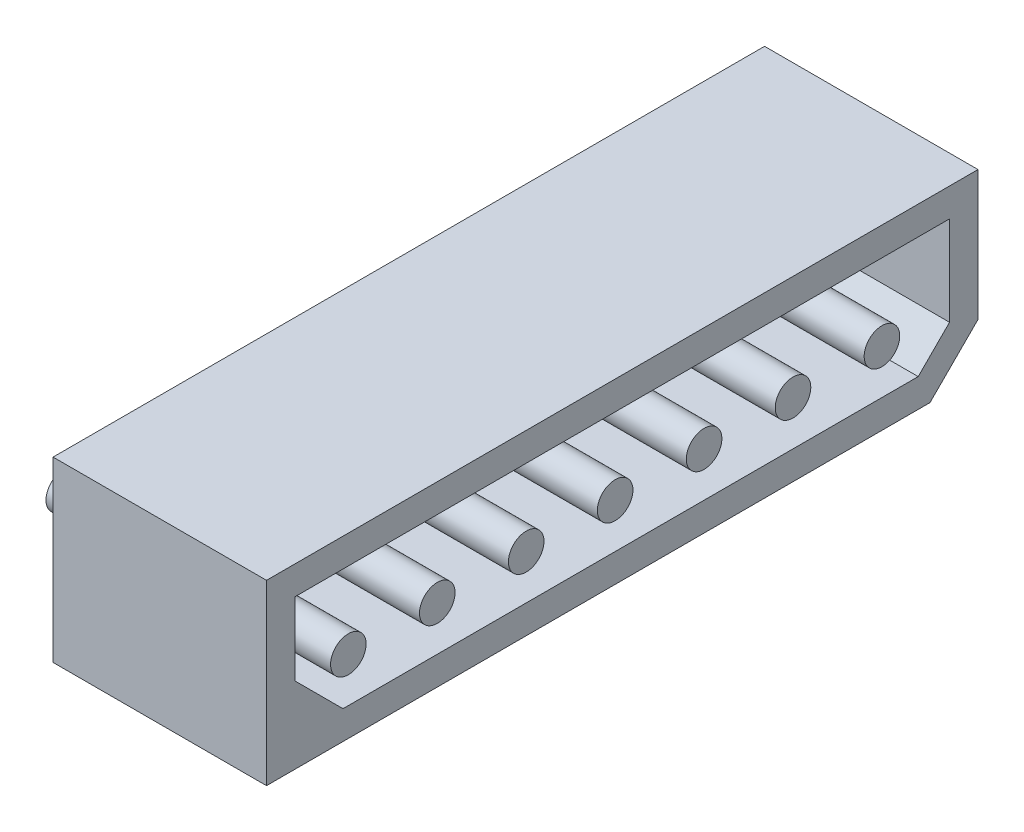
ISO-10303-21;
HEADER;
FILE_DESCRIPTION(('STEP AP214'),'2;1');
FILE_NAME('part.step','',(''),(''),'','','');
FILE_SCHEMA(('AUTOMOTIVE_DESIGN { 1 0 10303 214 1 1 1 1 }'));
ENDSEC;
DATA;
#1=APPLICATION_CONTEXT('core data for automotive mechanical design processes');
#2=APPLICATION_PROTOCOL_DEFINITION('international standard','automotive_design',2000,#1);
#3=PRODUCT_CONTEXT('',#1,'mechanical');
#4=PRODUCT('Part','Part','',(#3));
#5=PRODUCT_RELATED_PRODUCT_CATEGORY('part','',(#4));
#6=PRODUCT_DEFINITION_FORMATION('','',#4);
#7=PRODUCT_DEFINITION_CONTEXT('part definition',#1,'design');
#8=PRODUCT_DEFINITION('design','',#6,#7);
#9=PRODUCT_DEFINITION_SHAPE('','',#8);
#10=(LENGTH_UNIT() NAMED_UNIT(*) SI_UNIT(.MILLI.,.METRE.));
#11=(NAMED_UNIT(*) PLANE_ANGLE_UNIT() SI_UNIT($,.RADIAN.));
#12=(NAMED_UNIT(*) SI_UNIT($,.STERADIAN.) SOLID_ANGLE_UNIT());
#13=UNCERTAINTY_MEASURE_WITH_UNIT(LENGTH_MEASURE(1.E-05),#10,'distance_accuracy_value','');
#14=(GEOMETRIC_REPRESENTATION_CONTEXT(3) GLOBAL_UNCERTAINTY_ASSIGNED_CONTEXT((#13)) GLOBAL_UNIT_ASSIGNED_CONTEXT((#10,
#11,#12)) REPRESENTATION_CONTEXT('',''));
#15=CARTESIAN_POINT('',(0.,0.,0.));
#16=DIRECTION('',(0.,0.,1.));
#17=DIRECTION('',(1.,0.,0.));
#18=AXIS2_PLACEMENT_3D('',#15,#16,#17);
#19=CARTESIAN_POINT('',(5.8,-0.65,-7.5));
#20=DIRECTION('',(1.,0.,0.));
#21=DIRECTION('',(0.,0.,-1.));
#22=AXIS2_PLACEMENT_3D('',#19,#20,#21);
#23=PLANE('',#22);
#24=CARTESIAN_POINT('',(5.8,-0.65,-7.5));
#25=DIRECTION('',(1.,0.,0.));
#26=DIRECTION('',(0.,0.,-1.));
#27=AXIS2_PLACEMENT_3D('',#24,#25,#26);
#28=CIRCLE('',#27,0.5);
#29=CARTESIAN_POINT('',(5.8,-0.65,-8.));
#30=VERTEX_POINT('',#29);
#31=EDGE_CURVE('E20',#30,#30,#28,.F.);
#32=ORIENTED_EDGE('',*,*,#31,.F.);
#33=EDGE_LOOP('',(#32));
#34=FACE_BOUND('',#33,.T.);
#35=ADVANCED_FACE('F17',(#34),#23,.T.);
#36=CARTESIAN_POINT('',(5.8,-0.65,-5.));
#37=DIRECTION('',(1.,0.,0.));
#38=DIRECTION('',(0.,0.,-1.));
#39=AXIS2_PLACEMENT_3D('',#36,#37,#38);
#40=PLANE('',#39);
#41=CARTESIAN_POINT('',(5.8,-0.65,-5.));
#42=DIRECTION('',(1.,0.,0.));
#43=DIRECTION('',(0.,0.,-1.));
#44=AXIS2_PLACEMENT_3D('',#41,#42,#43);
#45=CIRCLE('',#44,0.5);
#46=CARTESIAN_POINT('',(5.8,-0.65,-5.5));
#47=VERTEX_POINT('',#46);
#48=EDGE_CURVE('E204',#47,#47,#45,.F.);
#49=ORIENTED_EDGE('',*,*,#48,.F.);
#50=EDGE_LOOP('',(#49));
#51=FACE_BOUND('',#50,.T.);
#52=ADVANCED_FACE('F215',(#51),#40,.T.);
#53=CARTESIAN_POINT('',(5.8,-0.65,-2.5));
#54=DIRECTION('',(1.,0.,0.));
#55=DIRECTION('',(0.,0.,-1.));
#56=AXIS2_PLACEMENT_3D('',#53,#54,#55);
#57=PLANE('',#56);
#58=CARTESIAN_POINT('',(5.8,-0.65,-2.5));
#59=DIRECTION('',(1.,0.,0.));
#60=DIRECTION('',(0.,0.,-1.));
#61=AXIS2_PLACEMENT_3D('',#58,#59,#60);
#62=CIRCLE('',#61,0.5);
#63=CARTESIAN_POINT('',(5.8,-0.65,-3.));
#64=VERTEX_POINT('',#63);
#65=EDGE_CURVE('E202',#64,#64,#62,.F.);
#66=ORIENTED_EDGE('',*,*,#65,.F.);
#67=EDGE_LOOP('',(#66));
#68=FACE_BOUND('',#67,.T.);
#69=ADVANCED_FACE('F220',(#68),#57,.T.);
#70=CARTESIAN_POINT('',(5.8,-0.65,0.));
#71=DIRECTION('',(1.,0.,0.));
#72=DIRECTION('',(0.,0.,-1.));
#73=AXIS2_PLACEMENT_3D('',#70,#71,#72);
#74=PLANE('',#73);
#75=CARTESIAN_POINT('',(5.8,-0.65,0.));
#76=DIRECTION('',(1.,0.,0.));
#77=DIRECTION('',(0.,0.,-1.));
#78=AXIS2_PLACEMENT_3D('',#75,#76,#77);
#79=CIRCLE('',#78,0.5);
#80=CARTESIAN_POINT('',(5.8,-0.65,-0.5));
#81=VERTEX_POINT('',#80);
#82=EDGE_CURVE('E199',#81,#81,#79,.F.);
#83=ORIENTED_EDGE('',*,*,#82,.F.);
#84=EDGE_LOOP('',(#83));
#85=FACE_BOUND('',#84,.T.);
#86=ADVANCED_FACE('F368',(#85),#74,.T.);
#87=CARTESIAN_POINT('',(5.8,-0.65,2.5));
#88=DIRECTION('',(1.,0.,0.));
#89=DIRECTION('',(0.,0.,-1.));
#90=AXIS2_PLACEMENT_3D('',#87,#88,#89);
#91=PLANE('',#90);
#92=CARTESIAN_POINT('',(5.8,-0.65,2.5));
#93=DIRECTION('',(1.,0.,0.));
#94=DIRECTION('',(0.,0.,-1.));
#95=AXIS2_PLACEMENT_3D('',#92,#93,#94);
#96=CIRCLE('',#95,0.5);
#97=CARTESIAN_POINT('',(5.8,-0.65,2.));
#98=VERTEX_POINT('',#97);
#99=EDGE_CURVE('E196',#98,#98,#96,.F.);
#100=ORIENTED_EDGE('',*,*,#99,.F.);
#101=EDGE_LOOP('',(#100));
#102=FACE_BOUND('',#101,.T.);
#103=ADVANCED_FACE('F364',(#102),#91,.T.);
#104=CARTESIAN_POINT('',(5.8,-0.65,5.));
#105=DIRECTION('',(1.,0.,0.));
#106=DIRECTION('',(0.,0.,-1.));
#107=AXIS2_PLACEMENT_3D('',#104,#105,#106);
#108=PLANE('',#107);
#109=CARTESIAN_POINT('',(5.8,-0.65,5.));
#110=DIRECTION('',(1.,0.,0.));
#111=DIRECTION('',(0.,0.,-1.));
#112=AXIS2_PLACEMENT_3D('',#109,#110,#111);
#113=CIRCLE('',#112,0.5);
#114=CARTESIAN_POINT('',(5.8,-0.65,4.5));
#115=VERTEX_POINT('',#114);
#116=EDGE_CURVE('E193',#115,#115,#113,.F.);
#117=ORIENTED_EDGE('',*,*,#116,.F.);
#118=EDGE_LOOP('',(#117));
#119=FACE_BOUND('',#118,.T.);
#120=ADVANCED_FACE('F360',(#119),#108,.T.);
#121=CARTESIAN_POINT('',(5.8,-0.65,7.5));
#122=DIRECTION('',(1.,0.,0.));
#123=DIRECTION('',(0.,0.,-1.));
#124=AXIS2_PLACEMENT_3D('',#121,#122,#123);
#125=PLANE('',#124);
#126=CARTESIAN_POINT('',(5.8,-0.65,7.5));
#127=DIRECTION('',(1.,0.,0.));
#128=DIRECTION('',(0.,0.,-1.));
#129=AXIS2_PLACEMENT_3D('',#126,#127,#128);
#130=CIRCLE('',#129,0.5);
#131=CARTESIAN_POINT('',(5.8,-0.65,7.));
#132=VERTEX_POINT('',#131);
#133=EDGE_CURVE('E190',#132,#132,#130,.F.);
#134=ORIENTED_EDGE('',*,*,#133,.F.);
#135=EDGE_LOOP('',(#134));
#136=FACE_BOUND('',#135,.T.);
#137=ADVANCED_FACE('F357',(#136),#125,.T.);
#138=CARTESIAN_POINT('',(5.8,-0.65,-7.5));
#139=DIRECTION('',(1.,0.,0.));
#140=DIRECTION('',(0.,0.,-1.));
#141=AXIS2_PLACEMENT_3D('',#138,#139,#140);
#142=CYLINDRICAL_SURFACE('',#141,0.5);
#143=ORIENTED_EDGE('',*,*,#31,.T.);
#144=EDGE_LOOP('',(#143));
#145=FACE_BOUND('',#144,.T.);
#146=CARTESIAN_POINT('',(0.8,-0.65,-7.5));
#147=DIRECTION('',(1.,0.,0.));
#148=DIRECTION('',(0.,0.,-1.));
#149=AXIS2_PLACEMENT_3D('',#146,#147,#148);
#150=CIRCLE('',#149,0.5);
#151=CARTESIAN_POINT('',(0.8,-0.65,-8.));
#152=VERTEX_POINT('',#151);
#153=EDGE_CURVE('E187',#152,#152,#150,.F.);
#154=ORIENTED_EDGE('',*,*,#153,.F.);
#155=EDGE_LOOP('',(#154));
#156=FACE_BOUND('',#155,.T.);
#157=ADVANCED_FACE('F211',(#145,#156),#142,.T.);
#158=CARTESIAN_POINT('',(5.8,-0.65,-5.));
#159=DIRECTION('',(1.,0.,0.));
#160=DIRECTION('',(0.,0.,-1.));
#161=AXIS2_PLACEMENT_3D('',#158,#159,#160);
#162=CYLINDRICAL_SURFACE('',#161,0.5);
#163=ORIENTED_EDGE('',*,*,#48,.T.);
#164=EDGE_LOOP('',(#163));
#165=FACE_BOUND('',#164,.T.);
#166=CARTESIAN_POINT('',(0.8,-0.65,-5.));
#167=DIRECTION('',(1.,0.,0.));
#168=DIRECTION('',(0.,0.,-1.));
#169=AXIS2_PLACEMENT_3D('',#166,#167,#168);
#170=CIRCLE('',#169,0.5);
#171=CARTESIAN_POINT('',(0.8,-0.65,-5.5));
#172=VERTEX_POINT('',#171);
#173=EDGE_CURVE('E184',#172,#172,#170,.F.);
#174=ORIENTED_EDGE('',*,*,#173,.F.);
#175=EDGE_LOOP('',(#174));
#176=FACE_BOUND('',#175,.T.);
#177=ADVANCED_FACE('F351',(#165,#176),#162,.T.);
#178=CARTESIAN_POINT('',(5.8,-0.65,-2.5));
#179=DIRECTION('',(1.,0.,0.));
#180=DIRECTION('',(0.,0.,-1.));
#181=AXIS2_PLACEMENT_3D('',#178,#179,#180);
#182=CYLINDRICAL_SURFACE('',#181,0.5);
#183=ORIENTED_EDGE('',*,*,#65,.T.);
#184=EDGE_LOOP('',(#183));
#185=FACE_BOUND('',#184,.T.);
#186=CARTESIAN_POINT('',(0.8,-0.65,-2.5));
#187=DIRECTION('',(1.,0.,0.));
#188=DIRECTION('',(0.,0.,-1.));
#189=AXIS2_PLACEMENT_3D('',#186,#187,#188);
#190=CIRCLE('',#189,0.5);
#191=CARTESIAN_POINT('',(0.8,-0.65,-3.));
#192=VERTEX_POINT('',#191);
#193=EDGE_CURVE('E181',#192,#192,#190,.F.);
#194=ORIENTED_EDGE('',*,*,#193,.F.);
#195=EDGE_LOOP('',(#194));
#196=FACE_BOUND('',#195,.T.);
#197=ADVANCED_FACE('F347',(#185,#196),#182,.T.);
#198=CARTESIAN_POINT('',(5.8,-0.65,0.));
#199=DIRECTION('',(1.,0.,0.));
#200=DIRECTION('',(0.,0.,-1.));
#201=AXIS2_PLACEMENT_3D('',#198,#199,#200);
#202=CYLINDRICAL_SURFACE('',#201,0.5);
#203=ORIENTED_EDGE('',*,*,#82,.T.);
#204=EDGE_LOOP('',(#203));
#205=FACE_BOUND('',#204,.T.);
#206=CARTESIAN_POINT('',(0.8,-0.65,0.));
#207=DIRECTION('',(1.,0.,0.));
#208=DIRECTION('',(0.,0.,-1.));
#209=AXIS2_PLACEMENT_3D('',#206,#207,#208);
#210=CIRCLE('',#209,0.5);
#211=CARTESIAN_POINT('',(0.8,-0.65,-0.5));
#212=VERTEX_POINT('',#211);
#213=EDGE_CURVE('E178',#212,#212,#210,.F.);
#214=ORIENTED_EDGE('',*,*,#213,.F.);
#215=EDGE_LOOP('',(#214));
#216=FACE_BOUND('',#215,.T.);
#217=ADVANCED_FACE('F343',(#205,#216),#202,.T.);
#218=CARTESIAN_POINT('',(5.8,-0.65,2.5));
#219=DIRECTION('',(1.,0.,0.));
#220=DIRECTION('',(0.,0.,-1.));
#221=AXIS2_PLACEMENT_3D('',#218,#219,#220);
#222=CYLINDRICAL_SURFACE('',#221,0.5);
#223=ORIENTED_EDGE('',*,*,#99,.T.);
#224=EDGE_LOOP('',(#223));
#225=FACE_BOUND('',#224,.T.);
#226=CARTESIAN_POINT('',(0.8,-0.65,2.5));
#227=DIRECTION('',(1.,0.,0.));
#228=DIRECTION('',(0.,0.,-1.));
#229=AXIS2_PLACEMENT_3D('',#226,#227,#228);
#230=CIRCLE('',#229,0.5);
#231=CARTESIAN_POINT('',(0.8,-0.65,2.));
#232=VERTEX_POINT('',#231);
#233=EDGE_CURVE('E175',#232,#232,#230,.F.);
#234=ORIENTED_EDGE('',*,*,#233,.F.);
#235=EDGE_LOOP('',(#234));
#236=FACE_BOUND('',#235,.T.);
#237=ADVANCED_FACE('F339',(#225,#236),#222,.T.);
#238=CARTESIAN_POINT('',(5.8,-0.65,5.));
#239=DIRECTION('',(1.,0.,0.));
#240=DIRECTION('',(0.,0.,-1.));
#241=AXIS2_PLACEMENT_3D('',#238,#239,#240);
#242=CYLINDRICAL_SURFACE('',#241,0.5);
#243=ORIENTED_EDGE('',*,*,#116,.T.);
#244=EDGE_LOOP('',(#243));
#245=FACE_BOUND('',#244,.T.);
#246=CARTESIAN_POINT('',(0.8,-0.65,5.));
#247=DIRECTION('',(1.,0.,0.));
#248=DIRECTION('',(0.,0.,-1.));
#249=AXIS2_PLACEMENT_3D('',#246,#247,#248);
#250=CIRCLE('',#249,0.5);
#251=CARTESIAN_POINT('',(0.8,-0.65,4.5));
#252=VERTEX_POINT('',#251);
#253=EDGE_CURVE('E172',#252,#252,#250,.F.);
#254=ORIENTED_EDGE('',*,*,#253,.F.);
#255=EDGE_LOOP('',(#254));
#256=FACE_BOUND('',#255,.T.);
#257=ADVANCED_FACE('F335',(#245,#256),#242,.T.);
#258=CARTESIAN_POINT('',(5.8,-0.65,7.5));
#259=DIRECTION('',(1.,0.,0.));
#260=DIRECTION('',(0.,0.,-1.));
#261=AXIS2_PLACEMENT_3D('',#258,#259,#260);
#262=CYLINDRICAL_SURFACE('',#261,0.5);
#263=ORIENTED_EDGE('',*,*,#133,.T.);
#264=EDGE_LOOP('',(#263));
#265=FACE_BOUND('',#264,.T.);
#266=CARTESIAN_POINT('',(0.8,-0.65,7.5));
#267=DIRECTION('',(1.,0.,0.));
#268=DIRECTION('',(0.,0.,-1.));
#269=AXIS2_PLACEMENT_3D('',#266,#267,#268);
#270=CIRCLE('',#269,0.5);
#271=CARTESIAN_POINT('',(0.8,-0.65,7.));
#272=VERTEX_POINT('',#271);
#273=EDGE_CURVE('E127',#272,#272,#270,.F.);
#274=ORIENTED_EDGE('',*,*,#273,.F.);
#275=EDGE_LOOP('',(#274));
#276=FACE_BOUND('',#275,.T.);
#277=ADVANCED_FACE('F331',(#265,#276),#262,.T.);
#278=CARTESIAN_POINT('',(0.8,0.,0.));
#279=DIRECTION('',(-1.,0.,0.));
#280=DIRECTION('',(0.,0.,1.));
#281=AXIS2_PLACEMENT_3D('',#278,#279,#280);
#282=PLANE('',#281);
#283=ORIENTED_EDGE('',*,*,#273,.T.);
#284=EDGE_LOOP('',(#283));
#285=FACE_BOUND('',#284,.T.);
#286=ORIENTED_EDGE('',*,*,#253,.T.);
#287=EDGE_LOOP('',(#286));
#288=FACE_BOUND('',#287,.T.);
#289=ORIENTED_EDGE('',*,*,#233,.T.);
#290=EDGE_LOOP('',(#289));
#291=FACE_BOUND('',#290,.T.);
#292=ORIENTED_EDGE('',*,*,#213,.T.);
#293=EDGE_LOOP('',(#292));
#294=FACE_BOUND('',#293,.T.);
#295=ORIENTED_EDGE('',*,*,#193,.T.);
#296=EDGE_LOOP('',(#295));
#297=FACE_BOUND('',#296,.T.);
#298=ORIENTED_EDGE('',*,*,#173,.T.);
#299=EDGE_LOOP('',(#298));
#300=FACE_BOUND('',#299,.T.);
#301=ORIENTED_EDGE('',*,*,#153,.T.);
#302=EDGE_LOOP('',(#301));
#303=FACE_BOUND('',#302,.T.);
#304=DIRECTION('',(0.,1.,0.));
#305=VECTOR('',#304,1.);
#306=CARTESIAN_POINT('',(0.8,-2.5,-9.2));
#307=LINE('',#306,#305);
#308=CARTESIAN_POINT('',(0.8,1.7,-9.2));
#309=VERTEX_POINT('',#308);
#310=CARTESIAN_POINT('',(0.8,-0.81862915,-9.2));
#311=VERTEX_POINT('',#310);
#312=EDGE_CURVE('E706',#309,#311,#307,.F.);
#313=ORIENTED_EDGE('',*,*,#312,.F.);
#314=DIRECTION('',(0.,0.,-1.));
#315=VECTOR('',#314,1.);
#316=CARTESIAN_POINT('',(0.8,1.7,10.));
#317=LINE('',#316,#315);
#318=CARTESIAN_POINT('',(0.8,1.7,9.2));
#319=VERTEX_POINT('',#318);
#320=EDGE_CURVE('E692',#319,#309,#317,.T.);
#321=ORIENTED_EDGE('',*,*,#320,.F.);
#322=DIRECTION('',(0.,1.,0.));
#323=VECTOR('',#322,1.);
#324=CARTESIAN_POINT('',(0.8,-2.5,9.2));
#325=LINE('',#324,#323);
#326=CARTESIAN_POINT('',(0.799999999999999,-0.35,9.2));
#327=VERTEX_POINT('',#326);
#328=EDGE_CURVE('E691',#327,#319,#325,.T.);
#329=ORIENTED_EDGE('',*,*,#328,.F.);
#330=DIRECTION('',(0.,0.707106781186548,0.707106781186548));
#331=VECTOR('',#330,1.);
#332=CARTESIAN_POINT('',(0.799999999999999,-0.35,9.2));
#333=LINE('',#332,#331);
#334=CARTESIAN_POINT('',(0.8,-1.7,7.85));
#335=VERTEX_POINT('',#334);
#336=EDGE_CURVE('E106',#335,#327,#333,.T.);
#337=ORIENTED_EDGE('',*,*,#336,.F.);
#338=DIRECTION('',(0.,0.,1.));
#339=VECTOR('',#338,1.);
#340=CARTESIAN_POINT('',(0.8,-1.7,10.));
#341=LINE('',#340,#339);
#342=CARTESIAN_POINT('',(0.799999999999999,-1.7,-8.31862915));
#343=VERTEX_POINT('',#342);
#344=EDGE_CURVE('E97',#343,#335,#341,.T.);
#345=ORIENTED_EDGE('',*,*,#344,.F.);
#346=DIRECTION('',(0.,-0.707106781186548,0.707106781186548));
#347=VECTOR('',#346,1.);
#348=CARTESIAN_POINT('',(0.799999999999999,-0.584314575,-9.434314575));
#349=LINE('',#348,#347);
#350=EDGE_CURVE('E103',#311,#343,#349,.T.);
#351=ORIENTED_EDGE('',*,*,#350,.F.);
#352=EDGE_LOOP('',(#313,#321,#329,#337,#345,#351));
#353=FACE_BOUND('',#352,.T.);
#354=ADVANCED_FACE('F102',(#285,#288,#291,#294,#297,#300,#303,#353),#282,.F.);
#355=CARTESIAN_POINT('',(6.,-0.584314575,-9.434314575));
#356=DIRECTION('',(0.,0.707106781186548,0.707106781186548));
#357=DIRECTION('',(0.,-0.707106781186548,0.707106781186548));
#358=AXIS2_PLACEMENT_3D('',#355,#356,#357);
#359=PLANE('',#358);
#360=ORIENTED_EDGE('',*,*,#350,.T.);
#361=DIRECTION('',(1.,0.,0.));
#362=VECTOR('',#361,1.);
#363=CARTESIAN_POINT('',(6.,-1.7,-8.31862915));
#364=LINE('',#363,#362);
#365=CARTESIAN_POINT('',(6.,-1.7,-8.31862915));
#366=VERTEX_POINT('',#365);
#367=EDGE_CURVE('E108',#366,#343,#364,.F.);
#368=ORIENTED_EDGE('',*,*,#367,.F.);
#369=DIRECTION('',(0.,-0.707106781186548,0.707106781186548));
#370=VECTOR('',#369,1.);
#371=CARTESIAN_POINT('',(6.,-0.584314575,-9.434314575));
#372=LINE('',#371,#370);
#373=CARTESIAN_POINT('',(6.,-0.81862915,-9.2));
#374=VERTEX_POINT('',#373);
#375=EDGE_CURVE('E117',#366,#374,#372,.F.);
#376=ORIENTED_EDGE('',*,*,#375,.T.);
#377=DIRECTION('',(1.,0.,0.));
#378=VECTOR('',#377,1.);
#379=CARTESIAN_POINT('',(6.,-0.81862915,-9.2));
#380=LINE('',#379,#378);
#381=EDGE_CURVE('E115',#311,#374,#380,.T.);
#382=ORIENTED_EDGE('',*,*,#381,.F.);
#383=EDGE_LOOP('',(#360,#368,#376,#382));
#384=FACE_BOUND('',#383,.T.);
#385=ADVANCED_FACE('F112',(#384),#359,.T.);
#386=CARTESIAN_POINT('',(6.,-1.7,10.));
#387=DIRECTION('',(0.,1.,0.));
#388=DIRECTION('',(0.,0.,1.));
#389=AXIS2_PLACEMENT_3D('',#386,#387,#388);
#390=PLANE('',#389);
#391=DIRECTION('',(0.,0.,1.));
#392=VECTOR('',#391,1.);
#393=CARTESIAN_POINT('',(6.,-1.7,0.));
#394=LINE('',#393,#392);
#395=CARTESIAN_POINT('',(6.,-1.7,7.85));
#396=VERTEX_POINT('',#395);
#397=EDGE_CURVE('E121',#366,#396,#394,.T.);
#398=ORIENTED_EDGE('',*,*,#397,.F.);
#399=ORIENTED_EDGE('',*,*,#367,.T.);
#400=ORIENTED_EDGE('',*,*,#344,.T.);
#401=DIRECTION('',(1.,0.,0.));
#402=VECTOR('',#401,1.);
#403=CARTESIAN_POINT('',(6.,-1.7,7.85));
#404=LINE('',#403,#402);
#405=EDGE_CURVE('E122',#396,#335,#404,.F.);
#406=ORIENTED_EDGE('',*,*,#405,.F.);
#407=EDGE_LOOP('',(#398,#399,#400,#406));
#408=FACE_BOUND('',#407,.T.);
#409=ADVANCED_FACE('F119',(#408),#390,.T.);
#410=CARTESIAN_POINT('',(6.,-0.35,9.2));
#411=DIRECTION('',(0.,0.707106781186548,-0.707106781186548));
#412=DIRECTION('',(0.,0.707106781186548,0.707106781186548));
#413=AXIS2_PLACEMENT_3D('',#410,#411,#412);
#414=PLANE('',#413);
#415=ORIENTED_EDGE('',*,*,#336,.T.);
#416=DIRECTION('',(-1.,0.,0.));
#417=VECTOR('',#416,1.);
#418=CARTESIAN_POINT('',(6.,-0.35,9.2));
#419=LINE('',#418,#417);
#420=CARTESIAN_POINT('',(6.,-0.35,9.2));
#421=VERTEX_POINT('',#420);
#422=EDGE_CURVE('E688',#421,#327,#419,.T.);
#423=ORIENTED_EDGE('',*,*,#422,.F.);
#424=DIRECTION('',(0.,0.707106781186547,0.707106781186548));
#425=VECTOR('',#424,1.);
#426=CARTESIAN_POINT('',(6.,-1.7,7.85));
#427=LINE('',#426,#425);
#428=EDGE_CURVE('E710',#396,#421,#427,.T.);
#429=ORIENTED_EDGE('',*,*,#428,.F.);
#430=ORIENTED_EDGE('',*,*,#405,.T.);
#431=EDGE_LOOP('',(#415,#423,#429,#430));
#432=FACE_BOUND('',#431,.T.);
#433=ADVANCED_FACE('F320',(#432),#414,.T.);
#434=CARTESIAN_POINT('',(6.,-2.5,9.2));
#435=DIRECTION('',(0.,0.,-1.));
#436=DIRECTION('',(-1.,0.,0.));
#437=AXIS2_PLACEMENT_3D('',#434,#435,#436);
#438=PLANE('',#437);
#439=ORIENTED_EDGE('',*,*,#328,.T.);
#440=DIRECTION('',(1.,0.,0.));
#441=VECTOR('',#440,1.);
#442=CARTESIAN_POINT('',(6.,1.7,9.2));
#443=LINE('',#442,#441);
#444=CARTESIAN_POINT('',(6.,1.7,9.2));
#445=VERTEX_POINT('',#444);
#446=EDGE_CURVE('E701',#445,#319,#443,.F.);
#447=ORIENTED_EDGE('',*,*,#446,.F.);
#448=DIRECTION('',(0.,1.,0.));
#449=VECTOR('',#448,1.);
#450=CARTESIAN_POINT('',(6.,0.,9.2));
#451=LINE('',#450,#449);
#452=EDGE_CURVE('E696',#421,#445,#451,.T.);
#453=ORIENTED_EDGE('',*,*,#452,.F.);
#454=ORIENTED_EDGE('',*,*,#422,.T.);
#455=EDGE_LOOP('',(#439,#447,#453,#454));
#456=FACE_BOUND('',#455,.T.);
#457=ADVANCED_FACE('F316',(#456),#438,.T.);
#458=CARTESIAN_POINT('',(6.,1.7,10.));
#459=DIRECTION('',(0.,-1.,0.));
#460=DIRECTION('',(0.,0.,-1.));
#461=AXIS2_PLACEMENT_3D('',#458,#459,#460);
#462=PLANE('',#461);
#463=DIRECTION('',(0.,0.,1.));
#464=VECTOR('',#463,1.);
#465=CARTESIAN_POINT('',(6.,1.7,0.));
#466=LINE('',#465,#464);
#467=CARTESIAN_POINT('',(6.,1.7,-9.2));
#468=VERTEX_POINT('',#467);
#469=EDGE_CURVE('E713',#445,#468,#466,.F.);
#470=ORIENTED_EDGE('',*,*,#469,.F.);
#471=ORIENTED_EDGE('',*,*,#446,.T.);
#472=ORIENTED_EDGE('',*,*,#320,.T.);
#473=DIRECTION('',(1.,0.,0.));
#474=VECTOR('',#473,1.);
#475=CARTESIAN_POINT('',(6.,1.7,-9.2));
#476=LINE('',#475,#474);
#477=EDGE_CURVE('E703',#468,#309,#476,.F.);
#478=ORIENTED_EDGE('',*,*,#477,.F.);
#479=EDGE_LOOP('',(#470,#471,#472,#478));
#480=FACE_BOUND('',#479,.T.);
#481=ADVANCED_FACE('F312',(#480),#462,.T.);
#482=CARTESIAN_POINT('',(6.,-2.5,-9.2));
#483=DIRECTION('',(0.,0.,1.));
#484=DIRECTION('',(1.,0.,0.));
#485=AXIS2_PLACEMENT_3D('',#482,#483,#484);
#486=PLANE('',#485);
#487=ORIENTED_EDGE('',*,*,#312,.T.);
#488=ORIENTED_EDGE('',*,*,#381,.T.);
#489=DIRECTION('',(0.,1.,0.));
#490=VECTOR('',#489,1.);
#491=CARTESIAN_POINT('',(6.,0.,-9.2));
#492=LINE('',#491,#490);
#493=EDGE_CURVE('E716',#468,#374,#492,.F.);
#494=ORIENTED_EDGE('',*,*,#493,.F.);
#495=ORIENTED_EDGE('',*,*,#477,.T.);
#496=EDGE_LOOP('',(#487,#488,#494,#495));
#497=FACE_BOUND('',#496,.T.);
#498=ADVANCED_FACE('F308',(#497),#486,.T.);
#499=CARTESIAN_POINT('',(6.,0.,0.));
#500=DIRECTION('',(-1.,0.,0.));
#501=DIRECTION('',(0.,0.,1.));
#502=AXIS2_PLACEMENT_3D('',#499,#500,#501);
#503=PLANE('',#502);
#504=ORIENTED_EDGE('',*,*,#493,.T.);
#505=ORIENTED_EDGE('',*,*,#375,.F.);
#506=ORIENTED_EDGE('',*,*,#397,.T.);
#507=ORIENTED_EDGE('',*,*,#428,.T.);
#508=ORIENTED_EDGE('',*,*,#452,.T.);
#509=ORIENTED_EDGE('',*,*,#469,.T.);
#510=EDGE_LOOP('',(#504,#505,#506,#507,#508,#509));
#511=FACE_BOUND('',#510,.T.);
#512=DIRECTION('',(0.,0.,-1.));
#513=VECTOR('',#512,1.);
#514=CARTESIAN_POINT('',(6.,2.5,10.));
#515=LINE('',#514,#513);
#516=CARTESIAN_POINT('',(6.,2.5,10.));
#517=VERTEX_POINT('',#516);
#518=CARTESIAN_POINT('',(6.,2.5,-10.));
#519=VERTEX_POINT('',#518);
#520=EDGE_CURVE('E738',#517,#519,#515,.T.);
#521=ORIENTED_EDGE('',*,*,#520,.F.);
#522=DIRECTION('',(0.,1.,0.));
#523=VECTOR('',#522,1.);
#524=CARTESIAN_POINT('',(6.,-2.5,10.));
#525=LINE('',#524,#523);
#526=CARTESIAN_POINT('',(6.,-2.5,10.));
#527=VERTEX_POINT('',#526);
#528=EDGE_CURVE('E735',#527,#517,#525,.T.);
#529=ORIENTED_EDGE('',*,*,#528,.F.);
#530=DIRECTION('',(0.,0.,1.));
#531=VECTOR('',#530,1.);
#532=CARTESIAN_POINT('',(6.,-2.5,10.));
#533=LINE('',#532,#531);
#534=CARTESIAN_POINT('',(6.,-2.5,-8.65));
#535=VERTEX_POINT('',#534);
#536=EDGE_CURVE('E730',#535,#527,#533,.T.);
#537=ORIENTED_EDGE('',*,*,#536,.F.);
#538=DIRECTION('',(0.,-0.707106781186548,0.707106781186548));
#539=VECTOR('',#538,1.);
#540=CARTESIAN_POINT('',(6.,-1.15,-10.));
#541=LINE('',#540,#539);
#542=CARTESIAN_POINT('',(6.,-1.15,-10.));
#543=VERTEX_POINT('',#542);
#544=EDGE_CURVE('E722',#543,#535,#541,.T.);
#545=ORIENTED_EDGE('',*,*,#544,.F.);
#546=DIRECTION('',(0.,1.,0.));
#547=VECTOR('',#546,1.);
#548=CARTESIAN_POINT('',(6.,-2.5,-10.));
#549=LINE('',#548,#547);
#550=EDGE_CURVE('E719',#519,#543,#549,.F.);
#551=ORIENTED_EDGE('',*,*,#550,.F.);
#552=EDGE_LOOP('',(#521,#529,#537,#545,#551));
#553=FACE_BOUND('',#552,.T.);
#554=ADVANCED_FACE('F304',(#511,#553),#503,.F.);
#555=CARTESIAN_POINT('',(-2.2,-0.65,-5.));
#556=DIRECTION('',(1.,0.,0.));
#557=DIRECTION('',(0.,0.,-1.));
#558=AXIS2_PLACEMENT_3D('',#555,#556,#557);
#559=PLANE('',#558);
#560=CARTESIAN_POINT('',(-2.2,-0.65,-5.));
#561=DIRECTION('',(1.,0.,0.));
#562=DIRECTION('',(0.,0.,-1.));
#563=AXIS2_PLACEMENT_3D('',#560,#561,#562);
#564=CIRCLE('',#563,0.5);
#565=CARTESIAN_POINT('',(-2.2,-0.65,-5.5));
#566=VERTEX_POINT('',#565);
#567=EDGE_CURVE('E166',#566,#566,#564,.T.);
#568=ORIENTED_EDGE('',*,*,#567,.F.);
#569=EDGE_LOOP('',(#568));
#570=FACE_BOUND('',#569,.T.);
#571=ADVANCED_FACE('F300',(#570),#559,.F.);
#572=CARTESIAN_POINT('',(-2.2,-0.65,-2.5));
#573=DIRECTION('',(1.,0.,0.));
#574=DIRECTION('',(0.,0.,-1.));
#575=AXIS2_PLACEMENT_3D('',#572,#573,#574);
#576=PLANE('',#575);
#577=CARTESIAN_POINT('',(-2.2,-0.65,-2.5));
#578=DIRECTION('',(1.,0.,0.));
#579=DIRECTION('',(0.,0.,-1.));
#580=AXIS2_PLACEMENT_3D('',#577,#578,#579);
#581=CIRCLE('',#580,0.5);
#582=CARTESIAN_POINT('',(-2.2,-0.65,-3.));
#583=VERTEX_POINT('',#582);
#584=EDGE_CURVE('E163',#583,#583,#581,.T.);
#585=ORIENTED_EDGE('',*,*,#584,.F.);
#586=EDGE_LOOP('',(#585));
#587=FACE_BOUND('',#586,.T.);
#588=ADVANCED_FACE('F296',(#587),#576,.F.);
#589=CARTESIAN_POINT('',(-2.2,-0.65,0.));
#590=DIRECTION('',(1.,0.,0.));
#591=DIRECTION('',(0.,0.,-1.));
#592=AXIS2_PLACEMENT_3D('',#589,#590,#591);
#593=PLANE('',#592);
#594=CARTESIAN_POINT('',(-2.2,-0.65,0.));
#595=DIRECTION('',(1.,0.,0.));
#596=DIRECTION('',(0.,0.,-1.));
#597=AXIS2_PLACEMENT_3D('',#594,#595,#596);
#598=CIRCLE('',#597,0.5);
#599=CARTESIAN_POINT('',(-2.2,-0.65,-0.5));
#600=VERTEX_POINT('',#599);
#601=EDGE_CURVE('E160',#600,#600,#598,.T.);
#602=ORIENTED_EDGE('',*,*,#601,.F.);
#603=EDGE_LOOP('',(#602));
#604=FACE_BOUND('',#603,.T.);
#605=ADVANCED_FACE('F292',(#604),#593,.F.);
#606=CARTESIAN_POINT('',(-2.2,-0.65,2.5));
#607=DIRECTION('',(1.,0.,0.));
#608=DIRECTION('',(0.,0.,-1.));
#609=AXIS2_PLACEMENT_3D('',#606,#607,#608);
#610=PLANE('',#609);
#611=CARTESIAN_POINT('',(-2.2,-0.65,2.5));
#612=DIRECTION('',(1.,0.,0.));
#613=DIRECTION('',(0.,0.,-1.));
#614=AXIS2_PLACEMENT_3D('',#611,#612,#613);
#615=CIRCLE('',#614,0.5);
#616=CARTESIAN_POINT('',(-2.2,-0.65,2.));
#617=VERTEX_POINT('',#616);
#618=EDGE_CURVE('E157',#617,#617,#615,.T.);
#619=ORIENTED_EDGE('',*,*,#618,.F.);
#620=EDGE_LOOP('',(#619));
#621=FACE_BOUND('',#620,.T.);
#622=ADVANCED_FACE('F288',(#621),#610,.F.);
#623=CARTESIAN_POINT('',(-2.2,-0.65,5.));
#624=DIRECTION('',(1.,0.,0.));
#625=DIRECTION('',(0.,0.,-1.));
#626=AXIS2_PLACEMENT_3D('',#623,#624,#625);
#627=PLANE('',#626);
#628=CARTESIAN_POINT('',(-2.2,-0.65,5.));
#629=DIRECTION('',(1.,0.,0.));
#630=DIRECTION('',(0.,0.,-1.));
#631=AXIS2_PLACEMENT_3D('',#628,#629,#630);
#632=CIRCLE('',#631,0.5);
#633=CARTESIAN_POINT('',(-2.2,-0.65,4.5));
#634=VERTEX_POINT('',#633);
#635=EDGE_CURVE('E154',#634,#634,#632,.T.);
#636=ORIENTED_EDGE('',*,*,#635,.F.);
#637=EDGE_LOOP('',(#636));
#638=FACE_BOUND('',#637,.T.);
#639=ADVANCED_FACE('F284',(#638),#627,.F.);
#640=CARTESIAN_POINT('',(-2.2,-0.65,7.5));
#641=DIRECTION('',(1.,0.,0.));
#642=DIRECTION('',(0.,0.,-1.));
#643=AXIS2_PLACEMENT_3D('',#640,#641,#642);
#644=PLANE('',#643);
#645=CARTESIAN_POINT('',(-2.2,-0.65,7.5));
#646=DIRECTION('',(1.,0.,0.));
#647=DIRECTION('',(0.,0.,-1.));
#648=AXIS2_PLACEMENT_3D('',#645,#646,#647);
#649=CIRCLE('',#648,0.5);
#650=CARTESIAN_POINT('',(-2.2,-0.65,7.));
#651=VERTEX_POINT('',#650);
#652=EDGE_CURVE('E150',#651,#651,#649,.T.);
#653=ORIENTED_EDGE('',*,*,#652,.F.);
#654=EDGE_LOOP('',(#653));
#655=FACE_BOUND('',#654,.T.);
#656=ADVANCED_FACE('F280',(#655),#644,.F.);
#657=CARTESIAN_POINT('',(6.,-2.5,-10.));
#658=DIRECTION('',(0.,0.,1.));
#659=DIRECTION('',(1.,0.,0.));
#660=AXIS2_PLACEMENT_3D('',#657,#658,#659);
#661=PLANE('',#660);
#662=DIRECTION('',(0.,1.,0.));
#663=VECTOR('',#662,1.);
#664=CARTESIAN_POINT('',(0.,0.,-10.));
#665=LINE('',#664,#663);
#666=CARTESIAN_POINT('',(0.,2.5,-10.));
#667=VERTEX_POINT('',#666);
#668=CARTESIAN_POINT('',(0.,-1.15,-10.));
#669=VERTEX_POINT('',#668);
#670=EDGE_CURVE('E153',#667,#669,#665,.F.);
#671=ORIENTED_EDGE('',*,*,#670,.F.);
#672=DIRECTION('',(1.,0.,0.));
#673=VECTOR('',#672,1.);
#674=CARTESIAN_POINT('',(6.,2.5,-10.));
#675=LINE('',#674,#673);
#676=EDGE_CURVE('E169',#519,#667,#675,.F.);
#677=ORIENTED_EDGE('',*,*,#676,.F.);
#678=ORIENTED_EDGE('',*,*,#550,.T.);
#679=DIRECTION('',(1.,0.,0.));
#680=VECTOR('',#679,1.);
#681=CARTESIAN_POINT('',(6.,-1.15,-10.));
#682=LINE('',#681,#680);
#683=EDGE_CURVE('E724',#669,#543,#682,.T.);
#684=ORIENTED_EDGE('',*,*,#683,.F.);
#685=EDGE_LOOP('',(#671,#677,#678,#684));
#686=FACE_BOUND('',#685,.T.);
#687=ADVANCED_FACE('F276',(#686),#661,.F.);
#688=CARTESIAN_POINT('',(6.,-1.15,-10.));
#689=DIRECTION('',(0.,0.707106781186548,0.707106781186548));
#690=DIRECTION('',(0.,-0.707106781186548,0.707106781186548));
#691=AXIS2_PLACEMENT_3D('',#688,#689,#690);
#692=PLANE('',#691);
#693=DIRECTION('',(0.,-0.707106781186547,0.707106781186548));
#694=VECTOR('',#693,1.);
#695=CARTESIAN_POINT('',(0.,-1.15,-10.));
#696=LINE('',#695,#694);
#697=CARTESIAN_POINT('',(0.,-2.5,-8.65));
#698=VERTEX_POINT('',#697);
#699=EDGE_CURVE('E745',#669,#698,#696,.T.);
#700=ORIENTED_EDGE('',*,*,#699,.F.);
#701=ORIENTED_EDGE('',*,*,#683,.T.);
#702=ORIENTED_EDGE('',*,*,#544,.T.);
#703=DIRECTION('',(1.,0.,0.));
#704=VECTOR('',#703,1.);
#705=CARTESIAN_POINT('',(6.,-2.5,-8.65));
#706=LINE('',#705,#704);
#707=EDGE_CURVE('E727',#698,#535,#706,.T.);
#708=ORIENTED_EDGE('',*,*,#707,.F.);
#709=EDGE_LOOP('',(#700,#701,#702,#708));
#710=FACE_BOUND('',#709,.T.);
#711=ADVANCED_FACE('F272',(#710),#692,.F.);
#712=CARTESIAN_POINT('',(6.,-2.5,10.));
#713=DIRECTION('',(0.,1.,0.));
#714=DIRECTION('',(0.,0.,1.));
#715=AXIS2_PLACEMENT_3D('',#712,#713,#714);
#716=PLANE('',#715);
#717=ORIENTED_EDGE('',*,*,#536,.T.);
#718=DIRECTION('',(-1.,0.,0.));
#719=VECTOR('',#718,1.);
#720=CARTESIAN_POINT('',(6.,-2.5,10.));
#721=LINE('',#720,#719);
#722=CARTESIAN_POINT('',(0.,-2.5,10.));
#723=VERTEX_POINT('',#722);
#724=EDGE_CURVE('E732',#723,#527,#721,.F.);
#725=ORIENTED_EDGE('',*,*,#724,.F.);
#726=DIRECTION('',(0.,0.,1.));
#727=VECTOR('',#726,1.);
#728=CARTESIAN_POINT('',(0.,-2.5,0.));
#729=LINE('',#728,#727);
#730=EDGE_CURVE('E748',#698,#723,#729,.T.);
#731=ORIENTED_EDGE('',*,*,#730,.F.);
#732=ORIENTED_EDGE('',*,*,#707,.T.);
#733=EDGE_LOOP('',(#717,#725,#731,#732));
#734=FACE_BOUND('',#733,.T.);
#735=ADVANCED_FACE('F269',(#734),#716,.F.);
#736=CARTESIAN_POINT('',(6.,-2.5,10.));
#737=DIRECTION('',(0.,0.,-1.));
#738=DIRECTION('',(-1.,0.,0.));
#739=AXIS2_PLACEMENT_3D('',#736,#737,#738);
#740=PLANE('',#739);
#741=ORIENTED_EDGE('',*,*,#528,.T.);
#742=DIRECTION('',(1.,0.,0.));
#743=VECTOR('',#742,1.);
#744=CARTESIAN_POINT('',(6.,2.5,10.));
#745=LINE('',#744,#743);
#746=CARTESIAN_POINT('',(0.,2.5,10.));
#747=VERTEX_POINT('',#746);
#748=EDGE_CURVE('E35',#747,#517,#745,.T.);
#749=ORIENTED_EDGE('',*,*,#748,.F.);
#750=DIRECTION('',(0.,1.,0.));
#751=VECTOR('',#750,1.);
#752=CARTESIAN_POINT('',(0.,0.,10.));
#753=LINE('',#752,#751);
#754=EDGE_CURVE('E751',#723,#747,#753,.T.);
#755=ORIENTED_EDGE('',*,*,#754,.F.);
#756=ORIENTED_EDGE('',*,*,#724,.T.);
#757=EDGE_LOOP('',(#741,#749,#755,#756));
#758=FACE_BOUND('',#757,.T.);
#759=ADVANCED_FACE('F265',(#758),#740,.F.);
#760=CARTESIAN_POINT('',(6.,2.5,10.));
#761=DIRECTION('',(0.,-1.,0.));
#762=DIRECTION('',(0.,0.,-1.));
#763=AXIS2_PLACEMENT_3D('',#760,#761,#762);
#764=PLANE('',#763);
#765=ORIENTED_EDGE('',*,*,#520,.T.);
#766=ORIENTED_EDGE('',*,*,#676,.T.);
#767=DIRECTION('',(0.,0.,1.));
#768=VECTOR('',#767,1.);
#769=CARTESIAN_POINT('',(0.,2.5,0.));
#770=LINE('',#769,#768);
#771=EDGE_CURVE('E149',#747,#667,#770,.F.);
#772=ORIENTED_EDGE('',*,*,#771,.F.);
#773=ORIENTED_EDGE('',*,*,#748,.T.);
#774=EDGE_LOOP('',(#765,#766,#772,#773));
#775=FACE_BOUND('',#774,.T.);
#776=ADVANCED_FACE('F261',(#775),#764,.F.);
#777=CARTESIAN_POINT('',(0.,-0.65,-5.));
#778=DIRECTION('',(1.,0.,0.));
#779=DIRECTION('',(0.,0.,-1.));
#780=AXIS2_PLACEMENT_3D('',#777,#778,#779);
#781=CYLINDRICAL_SURFACE('',#780,0.5);
#782=CARTESIAN_POINT('',(0.,-0.65,-5.));
#783=DIRECTION('',(1.,0.,0.));
#784=DIRECTION('',(0.,0.,-1.));
#785=AXIS2_PLACEMENT_3D('',#782,#783,#784);
#786=CIRCLE('',#785,0.5);
#787=CARTESIAN_POINT('',(0.,-0.65,-5.5));
#788=VERTEX_POINT('',#787);
#789=EDGE_CURVE('E146',#788,#788,#786,.T.);
#790=ORIENTED_EDGE('',*,*,#789,.F.);
#791=EDGE_LOOP('',(#790));
#792=FACE_BOUND('',#791,.T.);
#793=ORIENTED_EDGE('',*,*,#567,.T.);
#794=EDGE_LOOP('',(#793));
#795=FACE_BOUND('',#794,.T.);
#796=ADVANCED_FACE('F257',(#792,#795),#781,.T.);
#797=CARTESIAN_POINT('',(0.,-0.65,-2.5));
#798=DIRECTION('',(1.,0.,0.));
#799=DIRECTION('',(0.,0.,-1.));
#800=AXIS2_PLACEMENT_3D('',#797,#798,#799);
#801=CYLINDRICAL_SURFACE('',#800,0.5);
#802=CARTESIAN_POINT('',(0.,-0.65,-2.5));
#803=DIRECTION('',(1.,0.,0.));
#804=DIRECTION('',(0.,0.,-1.));
#805=AXIS2_PLACEMENT_3D('',#802,#803,#804);
#806=CIRCLE('',#805,0.5);
#807=CARTESIAN_POINT('',(0.,-0.65,-3.));
#808=VERTEX_POINT('',#807);
#809=EDGE_CURVE('E143',#808,#808,#806,.T.);
#810=ORIENTED_EDGE('',*,*,#809,.F.);
#811=EDGE_LOOP('',(#810));
#812=FACE_BOUND('',#811,.T.);
#813=ORIENTED_EDGE('',*,*,#584,.T.);
#814=EDGE_LOOP('',(#813));
#815=FACE_BOUND('',#814,.T.);
#816=ADVANCED_FACE('F253',(#812,#815),#801,.T.);
#817=CARTESIAN_POINT('',(0.,-0.65,0.));
#818=DIRECTION('',(1.,0.,0.));
#819=DIRECTION('',(0.,0.,-1.));
#820=AXIS2_PLACEMENT_3D('',#817,#818,#819);
#821=CYLINDRICAL_SURFACE('',#820,0.5);
#822=CARTESIAN_POINT('',(0.,-0.65,0.));
#823=DIRECTION('',(1.,0.,0.));
#824=DIRECTION('',(0.,0.,-1.));
#825=AXIS2_PLACEMENT_3D('',#822,#823,#824);
#826=CIRCLE('',#825,0.5);
#827=CARTESIAN_POINT('',(0.,-0.65,-0.5));
#828=VERTEX_POINT('',#827);
#829=EDGE_CURVE('E140',#828,#828,#826,.T.);
#830=ORIENTED_EDGE('',*,*,#829,.F.);
#831=EDGE_LOOP('',(#830));
#832=FACE_BOUND('',#831,.T.);
#833=ORIENTED_EDGE('',*,*,#601,.T.);
#834=EDGE_LOOP('',(#833));
#835=FACE_BOUND('',#834,.T.);
#836=ADVANCED_FACE('F249',(#832,#835),#821,.T.);
#837=CARTESIAN_POINT('',(0.,-0.65,2.5));
#838=DIRECTION('',(1.,0.,0.));
#839=DIRECTION('',(0.,0.,-1.));
#840=AXIS2_PLACEMENT_3D('',#837,#838,#839);
#841=CYLINDRICAL_SURFACE('',#840,0.5);
#842=CARTESIAN_POINT('',(0.,-0.65,2.5));
#843=DIRECTION('',(1.,0.,0.));
#844=DIRECTION('',(0.,0.,-1.));
#845=AXIS2_PLACEMENT_3D('',#842,#843,#844);
#846=CIRCLE('',#845,0.5);
#847=CARTESIAN_POINT('',(0.,-0.65,2.));
#848=VERTEX_POINT('',#847);
#849=EDGE_CURVE('E137',#848,#848,#846,.T.);
#850=ORIENTED_EDGE('',*,*,#849,.F.);
#851=EDGE_LOOP('',(#850));
#852=FACE_BOUND('',#851,.T.);
#853=ORIENTED_EDGE('',*,*,#618,.T.);
#854=EDGE_LOOP('',(#853));
#855=FACE_BOUND('',#854,.T.);
#856=ADVANCED_FACE('F245',(#852,#855),#841,.T.);
#857=CARTESIAN_POINT('',(0.,-0.65,5.));
#858=DIRECTION('',(1.,0.,0.));
#859=DIRECTION('',(0.,0.,-1.));
#860=AXIS2_PLACEMENT_3D('',#857,#858,#859);
#861=CYLINDRICAL_SURFACE('',#860,0.5);
#862=CARTESIAN_POINT('',(0.,-0.65,5.));
#863=DIRECTION('',(1.,0.,0.));
#864=DIRECTION('',(0.,0.,-1.));
#865=AXIS2_PLACEMENT_3D('',#862,#863,#864);
#866=CIRCLE('',#865,0.5);
#867=CARTESIAN_POINT('',(0.,-0.65,4.5));
#868=VERTEX_POINT('',#867);
#869=EDGE_CURVE('E134',#868,#868,#866,.T.);
#870=ORIENTED_EDGE('',*,*,#869,.F.);
#871=EDGE_LOOP('',(#870));
#872=FACE_BOUND('',#871,.T.);
#873=ORIENTED_EDGE('',*,*,#635,.T.);
#874=EDGE_LOOP('',(#873));
#875=FACE_BOUND('',#874,.T.);
#876=ADVANCED_FACE('F241',(#872,#875),#861,.T.);
#877=CARTESIAN_POINT('',(0.,-0.65,7.5));
#878=DIRECTION('',(1.,0.,0.));
#879=DIRECTION('',(0.,0.,-1.));
#880=AXIS2_PLACEMENT_3D('',#877,#878,#879);
#881=CYLINDRICAL_SURFACE('',#880,0.5);
#882=CARTESIAN_POINT('',(0.,-0.65,7.5));
#883=DIRECTION('',(1.,0.,0.));
#884=DIRECTION('',(0.,0.,-1.));
#885=AXIS2_PLACEMENT_3D('',#882,#883,#884);
#886=CIRCLE('',#885,0.5);
#887=CARTESIAN_POINT('',(0.,-0.65,7.));
#888=VERTEX_POINT('',#887);
#889=EDGE_CURVE('E131',#888,#888,#886,.T.);
#890=ORIENTED_EDGE('',*,*,#889,.F.);
#891=EDGE_LOOP('',(#890));
#892=FACE_BOUND('',#891,.T.);
#893=ORIENTED_EDGE('',*,*,#652,.T.);
#894=EDGE_LOOP('',(#893));
#895=FACE_BOUND('',#894,.T.);
#896=ADVANCED_FACE('F237',(#892,#895),#881,.T.);
#897=CARTESIAN_POINT('',(-2.2,-0.65,-7.5));
#898=DIRECTION('',(1.,0.,0.));
#899=DIRECTION('',(0.,0.,-1.));
#900=AXIS2_PLACEMENT_3D('',#897,#898,#899);
#901=PLANE('',#900);
#902=CARTESIAN_POINT('',(-2.2,-0.65,-7.5));
#903=DIRECTION('',(1.,0.,0.));
#904=DIRECTION('',(0.,0.,-1.));
#905=AXIS2_PLACEMENT_3D('',#902,#903,#904);
#906=CIRCLE('',#905,0.5);
#907=CARTESIAN_POINT('',(-2.2,-0.65,-8.));
#908=VERTEX_POINT('',#907);
#909=EDGE_CURVE('E26',#908,#908,#906,.T.);
#910=ORIENTED_EDGE('',*,*,#909,.F.);
#911=EDGE_LOOP('',(#910));
#912=FACE_BOUND('',#911,.T.);
#913=ADVANCED_FACE('F230',(#912),#901,.F.);
#914=CARTESIAN_POINT('',(0.,0.,0.));
#915=DIRECTION('',(-1.,0.,0.));
#916=DIRECTION('',(0.,0.,1.));
#917=AXIS2_PLACEMENT_3D('',#914,#915,#916);
#918=PLANE('',#917);
#919=ORIENTED_EDGE('',*,*,#889,.T.);
#920=EDGE_LOOP('',(#919));
#921=FACE_BOUND('',#920,.T.);
#922=ORIENTED_EDGE('',*,*,#869,.T.);
#923=EDGE_LOOP('',(#922));
#924=FACE_BOUND('',#923,.T.);
#925=ORIENTED_EDGE('',*,*,#849,.T.);
#926=EDGE_LOOP('',(#925));
#927=FACE_BOUND('',#926,.T.);
#928=ORIENTED_EDGE('',*,*,#829,.T.);
#929=EDGE_LOOP('',(#928));
#930=FACE_BOUND('',#929,.T.);
#931=ORIENTED_EDGE('',*,*,#809,.T.);
#932=EDGE_LOOP('',(#931));
#933=FACE_BOUND('',#932,.T.);
#934=ORIENTED_EDGE('',*,*,#789,.T.);
#935=EDGE_LOOP('',(#934));
#936=FACE_BOUND('',#935,.T.);
#937=CARTESIAN_POINT('',(0.,-0.65,-7.5));
#938=DIRECTION('',(1.,0.,0.));
#939=DIRECTION('',(0.,0.,-1.));
#940=AXIS2_PLACEMENT_3D('',#937,#938,#939);
#941=CIRCLE('',#940,0.5);
#942=CARTESIAN_POINT('',(0.,-0.65,-8.));
#943=VERTEX_POINT('',#942);
#944=EDGE_CURVE('E11',#943,#943,#941,.F.);
#945=ORIENTED_EDGE('',*,*,#944,.F.);
#946=EDGE_LOOP('',(#945));
#947=FACE_BOUND('',#946,.T.);
#948=ORIENTED_EDGE('',*,*,#754,.T.);
#949=ORIENTED_EDGE('',*,*,#771,.T.);
#950=ORIENTED_EDGE('',*,*,#670,.T.);
#951=ORIENTED_EDGE('',*,*,#699,.T.);
#952=ORIENTED_EDGE('',*,*,#730,.T.);
#953=EDGE_LOOP('',(#948,#949,#950,#951,#952));
#954=FACE_BOUND('',#953,.T.);
#955=ADVANCED_FACE('F224',(#921,#924,#927,#930,#933,#936,#947,#954),#918,.T.);
#956=CARTESIAN_POINT('',(0.,-0.65,-7.5));
#957=DIRECTION('',(1.,0.,0.));
#958=DIRECTION('',(0.,0.,-1.));
#959=AXIS2_PLACEMENT_3D('',#956,#957,#958);
#960=CYLINDRICAL_SURFACE('',#959,0.5);
#961=ORIENTED_EDGE('',*,*,#944,.T.);
#962=EDGE_LOOP('',(#961));
#963=FACE_BOUND('',#962,.T.);
#964=ORIENTED_EDGE('',*,*,#909,.T.);
#965=EDGE_LOOP('',(#964));
#966=FACE_BOUND('',#965,.T.);
#967=ADVANCED_FACE('F222',(#963,#966),#960,.T.);
#968=CLOSED_SHELL('',(#35,#52,#69,#86,#103,#120,#137,#157,#177,#197,#217,#237,#257,#277,#354,
#385,#409,#433,#457,#481,#498,#554,#571,#588,#605,#622,#639,#656,#687,#711,#735,#759,#776,#796,
#816,#836,#856,#876,#896,#913,#955,#967));
#969=MANIFOLD_SOLID_BREP('B1',#968);
#970=ADVANCED_BREP_SHAPE_REPRESENTATION('',(#18,#969),#14);
#971=SHAPE_DEFINITION_REPRESENTATION(#9,#970);
ENDSEC;
END-ISO-10303-21;
